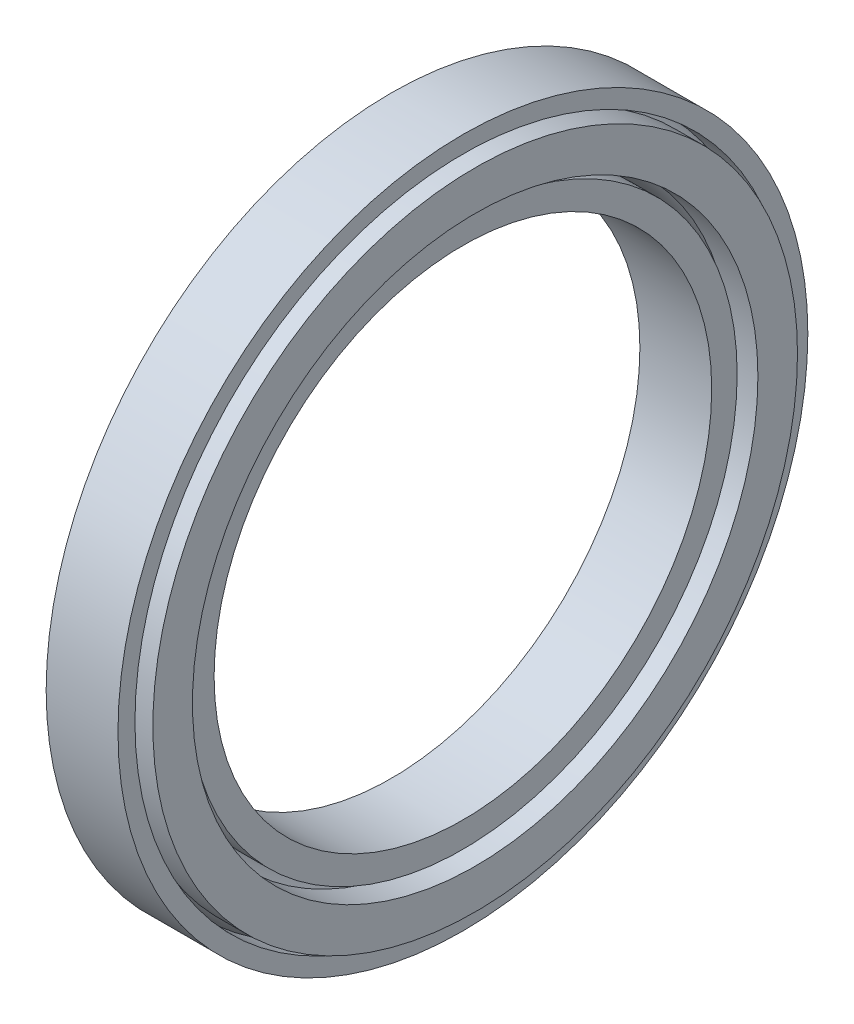
ISO-10303-21;
HEADER;
FILE_DESCRIPTION(('STEP AP214'),'2;1');
FILE_NAME('part.step','',(''),(''),'','','');
FILE_SCHEMA(('AUTOMOTIVE_DESIGN { 1 0 10303 214 1 1 1 1 }'));
ENDSEC;
DATA;
#1=APPLICATION_CONTEXT('core data for automotive mechanical design processes');
#2=APPLICATION_PROTOCOL_DEFINITION('international standard','automotive_design',2000,#1);
#3=PRODUCT_CONTEXT('',#1,'mechanical');
#4=PRODUCT('Part','Part','',(#3));
#5=PRODUCT_RELATED_PRODUCT_CATEGORY('part','',(#4));
#6=PRODUCT_DEFINITION_FORMATION('','',#4);
#7=PRODUCT_DEFINITION_CONTEXT('part definition',#1,'design');
#8=PRODUCT_DEFINITION('design','',#6,#7);
#9=PRODUCT_DEFINITION_SHAPE('','',#8);
#10=(LENGTH_UNIT() NAMED_UNIT(*) SI_UNIT(.MILLI.,.METRE.));
#11=(NAMED_UNIT(*) PLANE_ANGLE_UNIT() SI_UNIT($,.RADIAN.));
#12=(NAMED_UNIT(*) SI_UNIT($,.STERADIAN.) SOLID_ANGLE_UNIT());
#13=UNCERTAINTY_MEASURE_WITH_UNIT(LENGTH_MEASURE(1.E-05),#10,'distance_accuracy_value','');
#14=(GEOMETRIC_REPRESENTATION_CONTEXT(3) GLOBAL_UNCERTAINTY_ASSIGNED_CONTEXT((#13)) GLOBAL_UNIT_ASSIGNED_CONTEXT((#10,
#11,#12)) REPRESENTATION_CONTEXT('',''));
#15=CARTESIAN_POINT('',(0.,0.,0.));
#16=DIRECTION('',(0.,0.,1.));
#17=DIRECTION('',(1.,0.,0.));
#18=AXIS2_PLACEMENT_3D('',#15,#16,#17);
#19=CARTESIAN_POINT('',(0.,0.,0.));
#20=DIRECTION('',(-1.,0.,0.));
#21=DIRECTION('',(0.,0.,1.));
#22=AXIS2_PLACEMENT_3D('',#19,#20,#21);
#23=CYLINDRICAL_SURFACE('',#22,22.);
#24=CARTESIAN_POINT('',(6.35,0.,0.));
#25=DIRECTION('',(-1.,0.,0.));
#26=DIRECTION('',(0.,0.,1.));
#27=AXIS2_PLACEMENT_3D('',#24,#25,#26);
#28=CIRCLE('',#27,22.);
#29=CARTESIAN_POINT('',(6.35,0.,22.));
#30=VERTEX_POINT('',#29);
#31=EDGE_CURVE('E18',#30,#30,#28,.F.);
#32=ORIENTED_EDGE('',*,*,#31,.T.);
#33=EDGE_LOOP('',(#32));
#34=FACE_BOUND('',#33,.T.);
#35=CARTESIAN_POINT('',(0.,0.,0.));
#36=DIRECTION('',(-1.,0.,0.));
#37=DIRECTION('',(0.,0.,1.));
#38=AXIS2_PLACEMENT_3D('',#35,#36,#37);
#39=CIRCLE('',#38,22.);
#40=CARTESIAN_POINT('',(0.,0.,22.));
#41=VERTEX_POINT('',#40);
#42=EDGE_CURVE('E58',#41,#41,#39,.T.);
#43=ORIENTED_EDGE('',*,*,#42,.T.);
#44=EDGE_LOOP('',(#43));
#45=FACE_BOUND('',#44,.T.);
#46=ADVANCED_FACE('F15',(#34,#45),#23,.F.);
#47=CARTESIAN_POINT('',(6.35,22.,0.));
#48=DIRECTION('',(-1.,0.,0.));
#49=DIRECTION('',(0.,0.,1.));
#50=AXIS2_PLACEMENT_3D('',#47,#48,#49);
#51=PLANE('',#50);
#52=ORIENTED_EDGE('',*,*,#31,.F.);
#53=EDGE_LOOP('',(#52));
#54=FACE_BOUND('',#53,.T.);
#55=CARTESIAN_POINT('',(6.35,0.,0.));
#56=DIRECTION('',(-1.,0.,0.));
#57=DIRECTION('',(0.,0.,1.));
#58=AXIS2_PLACEMENT_3D('',#55,#56,#57);
#59=CIRCLE('',#58,24.25);
#60=CARTESIAN_POINT('',(6.35,0.,24.25));
#61=VERTEX_POINT('',#60);
#62=EDGE_CURVE('E56',#61,#61,#59,.T.);
#63=ORIENTED_EDGE('',*,*,#62,.F.);
#64=EDGE_LOOP('',(#63));
#65=FACE_BOUND('',#64,.T.);
#66=ADVANCED_FACE('F66',(#54,#65),#51,.F.);
#67=CARTESIAN_POINT('',(0.,22.,0.));
#68=DIRECTION('',(1.,0.,0.));
#69=DIRECTION('',(0.,0.,-1.));
#70=AXIS2_PLACEMENT_3D('',#67,#68,#69);
#71=PLANE('',#70);
#72=CARTESIAN_POINT('',(0.,0.,0.));
#73=DIRECTION('',(-1.,0.,0.));
#74=DIRECTION('',(0.,0.,1.));
#75=AXIS2_PLACEMENT_3D('',#72,#73,#74);
#76=CIRCLE('',#75,24.25);
#77=CARTESIAN_POINT('',(0.,0.,24.25));
#78=VERTEX_POINT('',#77);
#79=EDGE_CURVE('E53',#78,#78,#76,.F.);
#80=ORIENTED_EDGE('',*,*,#79,.F.);
#81=EDGE_LOOP('',(#80));
#82=FACE_BOUND('',#81,.T.);
#83=ORIENTED_EDGE('',*,*,#42,.F.);
#84=EDGE_LOOP('',(#83));
#85=FACE_BOUND('',#84,.T.);
#86=ADVANCED_FACE('F69',(#82,#85),#71,.F.);
#87=CARTESIAN_POINT('',(0.,0.,0.));
#88=DIRECTION('',(-1.,0.,0.));
#89=DIRECTION('',(0.,0.,1.));
#90=AXIS2_PLACEMENT_3D('',#87,#88,#89);
#91=CYLINDRICAL_SURFACE('',#90,24.25);
#92=ORIENTED_EDGE('',*,*,#62,.T.);
#93=EDGE_LOOP('',(#92));
#94=FACE_BOUND('',#93,.T.);
#95=CARTESIAN_POINT('',(3.875,0.,0.));
#96=DIRECTION('',(-1.,0.,0.));
#97=DIRECTION('',(0.,0.,1.));
#98=AXIS2_PLACEMENT_3D('',#95,#96,#97);
#99=CIRCLE('',#98,24.25);
#100=CARTESIAN_POINT('',(3.875,0.,24.25));
#101=VERTEX_POINT('',#100);
#102=EDGE_CURVE('E30',#101,#101,#99,.T.);
#103=ORIENTED_EDGE('',*,*,#102,.F.);
#104=EDGE_LOOP('',(#103));
#105=FACE_BOUND('',#104,.T.);
#106=ADVANCED_FACE('F72',(#94,#105),#91,.T.);
#107=CARTESIAN_POINT('',(0.,0.,0.));
#108=DIRECTION('',(-1.,0.,0.));
#109=DIRECTION('',(0.,0.,1.));
#110=AXIS2_PLACEMENT_3D('',#107,#108,#109);
#111=CYLINDRICAL_SURFACE('',#110,24.25);
#112=CARTESIAN_POINT('',(2.475,0.,0.));
#113=DIRECTION('',(-1.,0.,0.));
#114=DIRECTION('',(0.,0.,1.));
#115=AXIS2_PLACEMENT_3D('',#112,#113,#114);
#116=CIRCLE('',#115,24.25);
#117=CARTESIAN_POINT('',(2.475,0.,24.25));
#118=VERTEX_POINT('',#117);
#119=EDGE_CURVE('E80',#118,#118,#116,.F.);
#120=ORIENTED_EDGE('',*,*,#119,.F.);
#121=EDGE_LOOP('',(#120));
#122=FACE_BOUND('',#121,.T.);
#123=ORIENTED_EDGE('',*,*,#79,.T.);
#124=EDGE_LOOP('',(#123));
#125=FACE_BOUND('',#124,.T.);
#126=ADVANCED_FACE('F75',(#122,#125),#111,.T.);
#127=CARTESIAN_POINT('',(3.175,0.,0.));
#128=DIRECTION('',(-1.,0.,0.));
#129=DIRECTION('',(0.,0.,1.));
#130=AXIS2_PLACEMENT_3D('',#127,#128,#129);
#131=TOROIDAL_SURFACE('',#130,26.65,2.5);
#132=ORIENTED_EDGE('',*,*,#102,.T.);
#133=EDGE_LOOP('',(#132));
#134=FACE_BOUND('',#133,.T.);
#135=CARTESIAN_POINT('',(5.0531639970993,0.,0.));
#136=DIRECTION('',(1.,0.,0.));
#137=DIRECTION('',(0.,0.,-1.));
#138=AXIS2_PLACEMENT_3D('',#135,#136,#137);
#139=CIRCLE('',#138,25.);
#140=CARTESIAN_POINT('',(5.0531639970993,0.,-25.));
#141=VERTEX_POINT('',#140);
#142=EDGE_CURVE('E82',#141,#141,#139,.T.);
#143=ORIENTED_EDGE('',*,*,#142,.T.);
#144=EDGE_LOOP('',(#143));
#145=FACE_BOUND('',#144,.T.);
#146=ADVANCED_FACE('F93',(#134,#145),#131,.T.);
#147=CARTESIAN_POINT('',(3.175,0.,0.));
#148=DIRECTION('',(-1.,0.,0.));
#149=DIRECTION('',(0.,0.,1.));
#150=AXIS2_PLACEMENT_3D('',#147,#148,#149);
#151=TOROIDAL_SURFACE('',#150,26.65,2.5);
#152=CARTESIAN_POINT('',(1.2968360029007,0.,0.));
#153=DIRECTION('',(1.,0.,0.));
#154=DIRECTION('',(0.,0.,-1.));
#155=AXIS2_PLACEMENT_3D('',#152,#153,#154);
#156=CIRCLE('',#155,25.);
#157=CARTESIAN_POINT('',(1.2968360029007,0.,-25.));
#158=VERTEX_POINT('',#157);
#159=EDGE_CURVE('E52',#158,#158,#156,.F.);
#160=ORIENTED_EDGE('',*,*,#159,.T.);
#161=EDGE_LOOP('',(#160));
#162=FACE_BOUND('',#161,.T.);
#163=ORIENTED_EDGE('',*,*,#119,.T.);
#164=EDGE_LOOP('',(#163));
#165=FACE_BOUND('',#164,.T.);
#166=ADVANCED_FACE('F97',(#162,#165),#151,.T.);
#167=CARTESIAN_POINT('',(0.,0.,0.));
#168=DIRECTION('',(1.,0.,0.));
#169=DIRECTION('',(0.,0.,-1.));
#170=AXIS2_PLACEMENT_3D('',#167,#168,#169);
#171=CYLINDRICAL_SURFACE('',#170,25.);
#172=CARTESIAN_POINT('',(7.435,0.,0.));
#173=DIRECTION('',(1.,0.,0.));
#174=DIRECTION('',(0.,0.,-1.));
#175=AXIS2_PLACEMENT_3D('',#172,#173,#174);
#176=CIRCLE('',#175,25.);
#177=CARTESIAN_POINT('',(7.435,0.,-25.));
#178=VERTEX_POINT('',#177);
#179=EDGE_CURVE('E49',#178,#178,#176,.F.);
#180=ORIENTED_EDGE('',*,*,#179,.F.);
#181=EDGE_LOOP('',(#180));
#182=FACE_BOUND('',#181,.T.);
#183=ORIENTED_EDGE('',*,*,#142,.F.);
#184=EDGE_LOOP('',(#183));
#185=FACE_BOUND('',#184,.T.);
#186=ADVANCED_FACE('F159',(#182,#185),#171,.F.);
#187=CARTESIAN_POINT('',(0.,0.,0.));
#188=DIRECTION('',(1.,0.,0.));
#189=DIRECTION('',(0.,0.,-1.));
#190=AXIS2_PLACEMENT_3D('',#187,#188,#189);
#191=CYLINDRICAL_SURFACE('',#190,25.);
#192=ORIENTED_EDGE('',*,*,#159,.F.);
#193=EDGE_LOOP('',(#192));
#194=FACE_BOUND('',#193,.T.);
#195=CARTESIAN_POINT('',(-1.085,0.,0.));
#196=DIRECTION('',(1.,0.,0.));
#197=DIRECTION('',(0.,0.,-1.));
#198=AXIS2_PLACEMENT_3D('',#195,#196,#197);
#199=CIRCLE('',#198,25.);
#200=CARTESIAN_POINT('',(-1.085,0.,-25.));
#201=VERTEX_POINT('',#200);
#202=EDGE_CURVE('E46',#201,#201,#199,.T.);
#203=ORIENTED_EDGE('',*,*,#202,.F.);
#204=EDGE_LOOP('',(#203));
#205=FACE_BOUND('',#204,.T.);
#206=ADVANCED_FACE('F155',(#194,#205),#191,.F.);
#207=CARTESIAN_POINT('',(7.435,28.5000000000001,0.));
#208=DIRECTION('',(1.,0.,0.));
#209=DIRECTION('',(0.,0.,-1.));
#210=AXIS2_PLACEMENT_3D('',#207,#208,#209);
#211=PLANE('',#210);
#212=ORIENTED_EDGE('',*,*,#179,.T.);
#213=EDGE_LOOP('',(#212));
#214=FACE_BOUND('',#213,.T.);
#215=CARTESIAN_POINT('',(7.435,0.,0.));
#216=DIRECTION('',(1.,0.,0.));
#217=DIRECTION('',(0.,0.,-1.));
#218=AXIS2_PLACEMENT_3D('',#215,#216,#217);
#219=CIRCLE('',#218,28.5000000000001);
#220=CARTESIAN_POINT('',(7.435,0.,-28.5000000000001));
#221=VERTEX_POINT('',#220);
#222=EDGE_CURVE('E43',#221,#221,#219,.F.);
#223=ORIENTED_EDGE('',*,*,#222,.F.);
#224=EDGE_LOOP('',(#223));
#225=FACE_BOUND('',#224,.T.);
#226=ADVANCED_FACE('F158',(#214,#225),#211,.T.);
#227=CARTESIAN_POINT('',(-1.085,28.5000000000001,0.));
#228=DIRECTION('',(-1.,0.,0.));
#229=DIRECTION('',(0.,0.,1.));
#230=AXIS2_PLACEMENT_3D('',#227,#228,#229);
#231=PLANE('',#230);
#232=CARTESIAN_POINT('',(-1.085,0.,0.));
#233=DIRECTION('',(1.,0.,0.));
#234=DIRECTION('',(0.,0.,-1.));
#235=AXIS2_PLACEMENT_3D('',#232,#233,#234);
#236=CIRCLE('',#235,28.5000000000001);
#237=CARTESIAN_POINT('',(-1.085,0.,-28.5000000000001));
#238=VERTEX_POINT('',#237);
#239=EDGE_CURVE('E39',#238,#238,#236,.T.);
#240=ORIENTED_EDGE('',*,*,#239,.F.);
#241=EDGE_LOOP('',(#240));
#242=FACE_BOUND('',#241,.T.);
#243=ORIENTED_EDGE('',*,*,#202,.T.);
#244=EDGE_LOOP('',(#243));
#245=FACE_BOUND('',#244,.T.);
#246=ADVANCED_FACE('F163',(#242,#245),#231,.T.);
#247=CARTESIAN_POINT('',(0.,0.,0.));
#248=DIRECTION('',(1.,0.,0.));
#249=DIRECTION('',(0.,0.,-1.));
#250=AXIS2_PLACEMENT_3D('',#247,#248,#249);
#251=CYLINDRICAL_SURFACE('',#250,28.5000000000001);
#252=ORIENTED_EDGE('',*,*,#222,.T.);
#253=EDGE_LOOP('',(#252));
#254=FACE_BOUND('',#253,.T.);
#255=CARTESIAN_POINT('',(4.85651717208002,0.,0.));
#256=DIRECTION('',(-1.,0.,0.));
#257=DIRECTION('',(0.,0.,1.));
#258=AXIS2_PLACEMENT_3D('',#255,#256,#257);
#259=CIRCLE('',#258,28.5);
#260=CARTESIAN_POINT('',(4.85651717208002,0.,28.5));
#261=VERTEX_POINT('',#260);
#262=EDGE_CURVE('E42',#261,#261,#259,.T.);
#263=ORIENTED_EDGE('',*,*,#262,.F.);
#264=EDGE_LOOP('',(#263));
#265=FACE_BOUND('',#264,.T.);
#266=ADVANCED_FACE('F165',(#254,#265),#251,.T.);
#267=CARTESIAN_POINT('',(0.,0.,0.));
#268=DIRECTION('',(1.,0.,0.));
#269=DIRECTION('',(0.,0.,-1.));
#270=AXIS2_PLACEMENT_3D('',#267,#268,#269);
#271=CYLINDRICAL_SURFACE('',#270,28.5000000000001);
#272=CARTESIAN_POINT('',(1.49348282792001,0.,0.));
#273=DIRECTION('',(-1.,0.,0.));
#274=DIRECTION('',(0.,0.,1.));
#275=AXIS2_PLACEMENT_3D('',#272,#273,#274);
#276=CIRCLE('',#275,28.5);
#277=CARTESIAN_POINT('',(1.49348282792001,0.,28.5));
#278=VERTEX_POINT('',#277);
#279=EDGE_CURVE('E145',#278,#278,#276,.F.);
#280=ORIENTED_EDGE('',*,*,#279,.F.);
#281=EDGE_LOOP('',(#280));
#282=FACE_BOUND('',#281,.T.);
#283=ORIENTED_EDGE('',*,*,#239,.T.);
#284=EDGE_LOOP('',(#283));
#285=FACE_BOUND('',#284,.T.);
#286=ADVANCED_FACE('F172',(#282,#285),#271,.T.);
#287=CARTESIAN_POINT('',(3.175,0.,0.));
#288=DIRECTION('',(-1.,0.,0.));
#289=DIRECTION('',(0.,0.,1.));
#290=AXIS2_PLACEMENT_3D('',#287,#288,#289);
#291=TOROIDAL_SURFACE('',#290,26.65,2.5);
#292=CARTESIAN_POINT('',(4.02793610546159,0.,0.));
#293=DIRECTION('',(-1.,0.,0.));
#294=DIRECTION('',(0.,0.,1.));
#295=AXIS2_PLACEMENT_3D('',#292,#293,#294);
#296=CIRCLE('',#295,29.0000000000001);
#297=CARTESIAN_POINT('',(4.02793610546159,0.,29.0000000000001));
#298=VERTEX_POINT('',#297);
#299=EDGE_CURVE('E143',#298,#298,#296,.F.);
#300=ORIENTED_EDGE('',*,*,#299,.T.);
#301=EDGE_LOOP('',(#300));
#302=FACE_BOUND('',#301,.T.);
#303=ORIENTED_EDGE('',*,*,#262,.T.);
#304=EDGE_LOOP('',(#303));
#305=FACE_BOUND('',#304,.T.);
#306=ADVANCED_FACE('F136',(#302,#305),#291,.T.);
#307=CARTESIAN_POINT('',(3.175,0.,0.));
#308=DIRECTION('',(-1.,0.,0.));
#309=DIRECTION('',(0.,0.,1.));
#310=AXIS2_PLACEMENT_3D('',#307,#308,#309);
#311=TOROIDAL_SURFACE('',#310,26.65,2.5);
#312=ORIENTED_EDGE('',*,*,#279,.T.);
#313=EDGE_LOOP('',(#312));
#314=FACE_BOUND('',#313,.T.);
#315=CARTESIAN_POINT('',(2.32206389453841,0.,0.));
#316=DIRECTION('',(-1.,0.,0.));
#317=DIRECTION('',(0.,0.,1.));
#318=AXIS2_PLACEMENT_3D('',#315,#316,#317);
#319=CIRCLE('',#318,29.0000000000001);
#320=CARTESIAN_POINT('',(2.32206389453841,0.,29.0000000000001));
#321=VERTEX_POINT('',#320);
#322=EDGE_CURVE('E38',#321,#321,#319,.T.);
#323=ORIENTED_EDGE('',*,*,#322,.T.);
#324=EDGE_LOOP('',(#323));
#325=FACE_BOUND('',#324,.T.);
#326=ADVANCED_FACE('F131',(#314,#325),#311,.T.);
#327=CARTESIAN_POINT('',(0.,0.,0.));
#328=DIRECTION('',(-1.,0.,0.));
#329=DIRECTION('',(0.,0.,1.));
#330=AXIS2_PLACEMENT_3D('',#327,#328,#329);
#331=CYLINDRICAL_SURFACE('',#330,29.0000000000001);
#332=CARTESIAN_POINT('',(6.35,0.,0.));
#333=DIRECTION('',(-1.,0.,0.));
#334=DIRECTION('',(0.,0.,1.));
#335=AXIS2_PLACEMENT_3D('',#332,#333,#334);
#336=CIRCLE('',#335,29.0000000000001);
#337=CARTESIAN_POINT('',(6.35,0.,29.0000000000001));
#338=VERTEX_POINT('',#337);
#339=EDGE_CURVE('E35',#338,#338,#336,.F.);
#340=ORIENTED_EDGE('',*,*,#339,.T.);
#341=EDGE_LOOP('',(#340));
#342=FACE_BOUND('',#341,.T.);
#343=ORIENTED_EDGE('',*,*,#299,.F.);
#344=EDGE_LOOP('',(#343));
#345=FACE_BOUND('',#344,.T.);
#346=ADVANCED_FACE('F127',(#342,#345),#331,.F.);
#347=CARTESIAN_POINT('',(0.,0.,0.));
#348=DIRECTION('',(-1.,0.,0.));
#349=DIRECTION('',(0.,0.,1.));
#350=AXIS2_PLACEMENT_3D('',#347,#348,#349);
#351=CYLINDRICAL_SURFACE('',#350,29.0000000000001);
#352=ORIENTED_EDGE('',*,*,#322,.F.);
#353=EDGE_LOOP('',(#352));
#354=FACE_BOUND('',#353,.T.);
#355=CARTESIAN_POINT('',(0.,0.,0.));
#356=DIRECTION('',(-1.,0.,0.));
#357=DIRECTION('',(0.,0.,1.));
#358=AXIS2_PLACEMENT_3D('',#355,#356,#357);
#359=CIRCLE('',#358,29.0000000000001);
#360=CARTESIAN_POINT('',(0.,0.,29.0000000000001));
#361=VERTEX_POINT('',#360);
#362=EDGE_CURVE('E27',#361,#361,#359,.T.);
#363=ORIENTED_EDGE('',*,*,#362,.T.);
#364=EDGE_LOOP('',(#363));
#365=FACE_BOUND('',#364,.T.);
#366=ADVANCED_FACE('F123',(#354,#365),#351,.F.);
#367=CARTESIAN_POINT('',(6.35,30.5000000000001,0.));
#368=DIRECTION('',(-1.,0.,0.));
#369=DIRECTION('',(0.,0.,1.));
#370=AXIS2_PLACEMENT_3D('',#367,#368,#369);
#371=PLANE('',#370);
#372=ORIENTED_EDGE('',*,*,#339,.F.);
#373=EDGE_LOOP('',(#372));
#374=FACE_BOUND('',#373,.T.);
#375=CARTESIAN_POINT('',(6.35,0.,0.));
#376=DIRECTION('',(-1.,0.,0.));
#377=DIRECTION('',(0.,0.,1.));
#378=AXIS2_PLACEMENT_3D('',#375,#376,#377);
#379=CIRCLE('',#378,30.5000000000001);
#380=CARTESIAN_POINT('',(6.35,0.,30.5000000000001));
#381=VERTEX_POINT('',#380);
#382=EDGE_CURVE('E22',#381,#381,#379,.T.);
#383=ORIENTED_EDGE('',*,*,#382,.F.);
#384=EDGE_LOOP('',(#383));
#385=FACE_BOUND('',#384,.T.);
#386=ADVANCED_FACE('F116',(#374,#385),#371,.F.);
#387=CARTESIAN_POINT('',(0.,29.0000000000001,0.));
#388=DIRECTION('',(1.,0.,0.));
#389=DIRECTION('',(0.,0.,-1.));
#390=AXIS2_PLACEMENT_3D('',#387,#388,#389);
#391=PLANE('',#390);
#392=CARTESIAN_POINT('',(0.,0.,0.));
#393=DIRECTION('',(-1.,0.,0.));
#394=DIRECTION('',(0.,0.,1.));
#395=AXIS2_PLACEMENT_3D('',#392,#393,#394);
#396=CIRCLE('',#395,30.5000000000001);
#397=CARTESIAN_POINT('',(0.,0.,30.5000000000001));
#398=VERTEX_POINT('',#397);
#399=EDGE_CURVE('E10',#398,#398,#396,.F.);
#400=ORIENTED_EDGE('',*,*,#399,.F.);
#401=EDGE_LOOP('',(#400));
#402=FACE_BOUND('',#401,.T.);
#403=ORIENTED_EDGE('',*,*,#362,.F.);
#404=EDGE_LOOP('',(#403));
#405=FACE_BOUND('',#404,.T.);
#406=ADVANCED_FACE('F111',(#402,#405),#391,.F.);
#407=CARTESIAN_POINT('',(0.,0.,0.));
#408=DIRECTION('',(-1.,0.,0.));
#409=DIRECTION('',(0.,0.,1.));
#410=AXIS2_PLACEMENT_3D('',#407,#408,#409);
#411=CYLINDRICAL_SURFACE('',#410,30.5000000000001);
#412=ORIENTED_EDGE('',*,*,#399,.T.);
#413=EDGE_LOOP('',(#412));
#414=FACE_BOUND('',#413,.T.);
#415=ORIENTED_EDGE('',*,*,#382,.T.);
#416=EDGE_LOOP('',(#415));
#417=FACE_BOUND('',#416,.T.);
#418=ADVANCED_FACE('F109',(#414,#417),#411,.T.);
#419=CLOSED_SHELL('',(#46,#66,#86,#106,#126,#146,#166,#186,#206,#226,#246,#266,#286,#306,#326,
#346,#366,#386,#406,#418));
#420=MANIFOLD_SOLID_BREP('B1',#419);
#421=ADVANCED_BREP_SHAPE_REPRESENTATION('',(#18,#420),#14);
#422=SHAPE_DEFINITION_REPRESENTATION(#9,#421);
ENDSEC;
END-ISO-10303-21;
